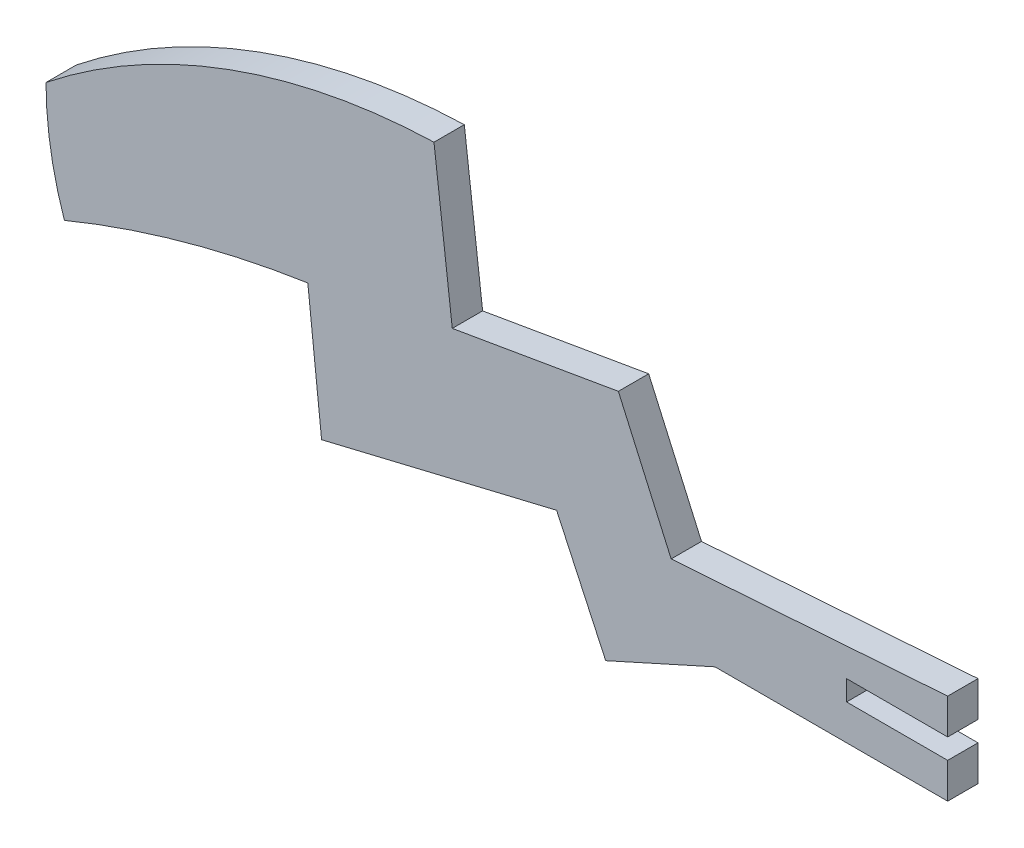
ISO-10303-21;
HEADER;
FILE_DESCRIPTION(('STEP AP214'),'2;1');
FILE_NAME('part.step','',(''),(''),'','','');
FILE_SCHEMA(('AUTOMOTIVE_DESIGN { 1 0 10303 214 1 1 1 1 }'));
ENDSEC;
DATA;
#1=APPLICATION_CONTEXT('core data for automotive mechanical design processes');
#2=APPLICATION_PROTOCOL_DEFINITION('international standard','automotive_design',2000,#1);
#3=PRODUCT_CONTEXT('',#1,'mechanical');
#4=PRODUCT('Part','Part','',(#3));
#5=PRODUCT_RELATED_PRODUCT_CATEGORY('part','',(#4));
#6=PRODUCT_DEFINITION_FORMATION('','',#4);
#7=PRODUCT_DEFINITION_CONTEXT('part definition',#1,'design');
#8=PRODUCT_DEFINITION('design','',#6,#7);
#9=PRODUCT_DEFINITION_SHAPE('','',#8);
#10=(LENGTH_UNIT() NAMED_UNIT(*) SI_UNIT(.MILLI.,.METRE.));
#11=(NAMED_UNIT(*) PLANE_ANGLE_UNIT() SI_UNIT($,.RADIAN.));
#12=(NAMED_UNIT(*) SI_UNIT($,.STERADIAN.) SOLID_ANGLE_UNIT());
#13=UNCERTAINTY_MEASURE_WITH_UNIT(LENGTH_MEASURE(1.E-05),#10,'distance_accuracy_value','');
#14=(GEOMETRIC_REPRESENTATION_CONTEXT(3) GLOBAL_UNCERTAINTY_ASSIGNED_CONTEXT((#13)) GLOBAL_UNIT_ASSIGNED_CONTEXT((#10,
#11,#12)) REPRESENTATION_CONTEXT('',''));
#15=CARTESIAN_POINT('',(0.,0.,0.));
#16=DIRECTION('',(0.,0.,1.));
#17=DIRECTION('',(1.,0.,0.));
#18=AXIS2_PLACEMENT_3D('',#15,#16,#17);
#19=CARTESIAN_POINT('',(29.713162877295,-25.3143678043269,3.));
#20=DIRECTION('',(0.,0.,-1.));
#21=DIRECTION('',(-1.,0.,0.));
#22=AXIS2_PLACEMENT_3D('',#19,#20,#21);
#23=CYLINDRICAL_SURFACE('',#22,64.8731226921538);
#24=CARTESIAN_POINT('',(29.713162877295,-25.3143678043269,0.));
#25=DIRECTION('',(0.,0.,1.));
#26=DIRECTION('',(1.,0.,0.));
#27=AXIS2_PLACEMENT_3D('',#24,#25,#26);
#28=CIRCLE('',#27,64.8731226921538);
#29=CARTESIAN_POINT('',(27.703067566427,39.5276059832782,0.));
#30=VERTEX_POINT('',#29);
#31=CARTESIAN_POINT('',(-10.6739269143685,25.4537819156634,0.));
#32=VERTEX_POINT('',#31);
#33=EDGE_CURVE('E183',#30,#32,#28,.T.);
#34=ORIENTED_EDGE('',*,*,#33,.T.);
#35=DIRECTION('',(0.,0.,-1.));
#36=VECTOR('',#35,1.);
#37=CARTESIAN_POINT('',(-10.6739269143685,25.4537819156634,3.));
#38=LINE('',#37,#36);
#39=CARTESIAN_POINT('',(-10.6739269143685,25.4537819156634,3.));
#40=VERTEX_POINT('',#39);
#41=EDGE_CURVE('E11',#40,#32,#38,.T.);
#42=ORIENTED_EDGE('',*,*,#41,.F.);
#43=CARTESIAN_POINT('',(29.713162877295,-25.3143678043269,3.));
#44=DIRECTION('',(0.,0.,1.));
#45=DIRECTION('',(1.,0.,0.));
#46=AXIS2_PLACEMENT_3D('',#43,#44,#45);
#47=CIRCLE('',#46,64.8731226921538);
#48=CARTESIAN_POINT('',(27.703067566427,39.5276059832782,3.));
#49=VERTEX_POINT('',#48);
#50=EDGE_CURVE('E216',#49,#40,#47,.T.);
#51=ORIENTED_EDGE('',*,*,#50,.F.);
#52=DIRECTION('',(0.,0.,-1.));
#53=VECTOR('',#52,1.);
#54=CARTESIAN_POINT('',(27.703067566427,39.5276059832782,3.));
#55=LINE('',#54,#53);
#56=EDGE_CURVE('E179',#49,#30,#55,.T.);
#57=ORIENTED_EDGE('',*,*,#56,.T.);
#58=EDGE_LOOP('',(#34,#42,#51,#57));
#59=FACE_BOUND('',#58,.T.);
#60=ADVANCED_FACE('F33',(#59),#23,.T.);
#61=CARTESIAN_POINT('',(23.1098661568595,25.4906827853954,3.));
#62=DIRECTION('',(0.,0.,-1.));
#63=DIRECTION('',(-1.,0.,0.));
#64=AXIS2_PLACEMENT_3D('',#61,#62,#63);
#65=CYLINDRICAL_SURFACE('',#64,33.7838132239944);
#66=CARTESIAN_POINT('',(23.1098661568595,25.4906827853954,0.));
#67=DIRECTION('',(0.,0.,1.));
#68=DIRECTION('',(1.,0.,0.));
#69=AXIS2_PLACEMENT_3D('',#66,#67,#68);
#70=CIRCLE('',#69,33.7838132239944);
#71=CARTESIAN_POINT('',(-8.85422266202396,14.5525356876339,0.));
#72=VERTEX_POINT('',#71);
#73=EDGE_CURVE('E186',#32,#72,#70,.T.);
#74=ORIENTED_EDGE('',*,*,#73,.T.);
#75=DIRECTION('',(0.,0.,-1.));
#76=VECTOR('',#75,1.);
#77=CARTESIAN_POINT('',(-8.85422266202396,14.5525356876339,3.));
#78=LINE('',#77,#76);
#79=CARTESIAN_POINT('',(-8.85422266202396,14.5525356876339,3.));
#80=VERTEX_POINT('',#79);
#81=EDGE_CURVE('E41',#80,#72,#78,.T.);
#82=ORIENTED_EDGE('',*,*,#81,.F.);
#83=CARTESIAN_POINT('',(23.1098661568595,25.4906827853954,3.));
#84=DIRECTION('',(0.,0.,1.));
#85=DIRECTION('',(1.,0.,0.));
#86=AXIS2_PLACEMENT_3D('',#83,#84,#85);
#87=CIRCLE('',#86,33.7838132239944);
#88=EDGE_CURVE('E119',#40,#80,#87,.T.);
#89=ORIENTED_EDGE('',*,*,#88,.F.);
#90=ORIENTED_EDGE('',*,*,#41,.T.);
#91=EDGE_LOOP('',(#74,#82,#89,#90));
#92=FACE_BOUND('',#91,.T.);
#93=ADVANCED_FACE('F319',(#92),#65,.T.);
#94=CARTESIAN_POINT('',(30.7068916071302,-81.4038849932265,3.));
#95=DIRECTION('',(0.,0.,-1.));
#96=DIRECTION('',(-1.,0.,0.));
#97=AXIS2_PLACEMENT_3D('',#94,#95,#96);
#98=CYLINDRICAL_SURFACE('',#97,103.79169731775);
#99=CARTESIAN_POINT('',(30.7068916071302,-81.4038849932265,0.));
#100=DIRECTION('',(0.,0.,-1.));
#101=DIRECTION('',(1.,0.,0.));
#102=AXIS2_PLACEMENT_3D('',#99,#100,#101);
#103=CIRCLE('',#102,103.79169731775);
#104=CARTESIAN_POINT('',(15.2236739770585,21.2264536202613,0.));
#105=VERTEX_POINT('',#104);
#106=EDGE_CURVE('E188',#72,#105,#103,.T.);
#107=ORIENTED_EDGE('',*,*,#106,.T.);
#108=DIRECTION('',(0.,0.,-1.));
#109=VECTOR('',#108,1.);
#110=CARTESIAN_POINT('',(15.2236739770585,21.2264536202613,3.));
#111=LINE('',#110,#109);
#112=CARTESIAN_POINT('',(15.2236739770585,21.2264536202613,3.));
#113=VERTEX_POINT('',#112);
#114=EDGE_CURVE('E250',#113,#105,#111,.T.);
#115=ORIENTED_EDGE('',*,*,#114,.F.);
#116=CARTESIAN_POINT('',(30.7068916071302,-81.4038849932265,3.));
#117=DIRECTION('',(0.,0.,-1.));
#118=DIRECTION('',(1.,0.,0.));
#119=AXIS2_PLACEMENT_3D('',#116,#117,#118);
#120=CIRCLE('',#119,103.79169731775);
#121=EDGE_CURVE('E258',#80,#113,#120,.T.);
#122=ORIENTED_EDGE('',*,*,#121,.F.);
#123=ORIENTED_EDGE('',*,*,#81,.T.);
#124=EDGE_LOOP('',(#107,#115,#122,#123));
#125=FACE_BOUND('',#124,.T.);
#126=ADVANCED_FACE('F256',(#125),#98,.F.);
#127=CARTESIAN_POINT('',(16.5860593290045,8.48039401672179,3.));
#128=DIRECTION('',(0.99433609317819,0.106281389730907,0.));
#129=DIRECTION('',(-0.106281389730907,0.994336093178191,0.));
#130=AXIS2_PLACEMENT_3D('',#127,#128,#129);
#131=PLANE('',#130);
#132=DIRECTION('',(0.106281389730907,-0.99433609317819,0.));
#133=VECTOR('',#132,1.);
#134=CARTESIAN_POINT('',(16.5860593290045,8.48039401672179,0.));
#135=LINE('',#134,#133);
#136=CARTESIAN_POINT('',(16.5860593290045,8.48039401672179,0.));
#137=VERTEX_POINT('',#136);
#138=EDGE_CURVE('E190',#105,#137,#135,.T.);
#139=ORIENTED_EDGE('',*,*,#138,.T.);
#140=DIRECTION('',(0.,0.,-1.));
#141=VECTOR('',#140,1.);
#142=CARTESIAN_POINT('',(16.5860593290045,8.48039401672179,3.));
#143=LINE('',#142,#141);
#144=CARTESIAN_POINT('',(16.5860593290045,8.48039401672179,3.));
#145=VERTEX_POINT('',#144);
#146=EDGE_CURVE('E247',#145,#137,#143,.T.);
#147=ORIENTED_EDGE('',*,*,#146,.F.);
#148=DIRECTION('',(0.106281389730907,-0.99433609317819,0.));
#149=VECTOR('',#148,1.);
#150=CARTESIAN_POINT('',(16.5860593290045,8.48039401672179,3.));
#151=LINE('',#150,#149);
#152=EDGE_CURVE('E276',#113,#145,#151,.T.);
#153=ORIENTED_EDGE('',*,*,#152,.F.);
#154=ORIENTED_EDGE('',*,*,#114,.T.);
#155=EDGE_LOOP('',(#139,#147,#153,#154));
#156=FACE_BOUND('',#155,.T.);
#157=ADVANCED_FACE('F267',(#156),#131,.F.);
#158=CARTESIAN_POINT('',(39.8319188868193,14.0605930201914,3.));
#159=DIRECTION('',(-0.233420126111625,0.972375979097608,0.));
#160=DIRECTION('',(-0.972375979097609,-0.233420126111625,0.));
#161=AXIS2_PLACEMENT_3D('',#158,#159,#160);
#162=PLANE('',#161);
#163=DIRECTION('',(0.972375979097609,0.233420126111625,0.));
#164=VECTOR('',#163,1.);
#165=CARTESIAN_POINT('',(39.8319188868193,14.0605930201914,0.));
#166=LINE('',#165,#164);
#167=CARTESIAN_POINT('',(39.8319188868193,14.0605930201914,0.));
#168=VERTEX_POINT('',#167);
#169=EDGE_CURVE('E192',#137,#168,#166,.T.);
#170=ORIENTED_EDGE('',*,*,#169,.T.);
#171=DIRECTION('',(0.,0.,-1.));
#172=VECTOR('',#171,1.);
#173=CARTESIAN_POINT('',(39.8319188868193,14.0605930201914,3.));
#174=LINE('',#173,#172);
#175=CARTESIAN_POINT('',(39.8319188868193,14.0605930201914,3.));
#176=VERTEX_POINT('',#175);
#177=EDGE_CURVE('E244',#176,#168,#174,.T.);
#178=ORIENTED_EDGE('',*,*,#177,.F.);
#179=DIRECTION('',(0.972375979097609,0.233420126111625,0.));
#180=VECTOR('',#179,1.);
#181=CARTESIAN_POINT('',(39.8319188868193,14.0605930201914,3.));
#182=LINE('',#181,#180);
#183=EDGE_CURVE('E273',#145,#176,#182,.T.);
#184=ORIENTED_EDGE('',*,*,#183,.F.);
#185=ORIENTED_EDGE('',*,*,#146,.T.);
#186=EDGE_LOOP('',(#170,#178,#184,#185));
#187=FACE_BOUND('',#186,.T.);
#188=ADVANCED_FACE('F271',(#187),#162,.F.);
#189=CARTESIAN_POINT('',(44.6870891655121,3.6032223236961,3.));
#190=DIRECTION('',(0.907010211533052,0.421108627523551,0.));
#191=DIRECTION('',(-0.421108627523551,0.907010211533052,0.));
#192=AXIS2_PLACEMENT_3D('',#189,#190,#191);
#193=PLANE('',#192);
#194=DIRECTION('',(0.421108627523551,-0.907010211533052,0.));
#195=VECTOR('',#194,1.);
#196=CARTESIAN_POINT('',(44.6870891655121,3.6032223236961,0.));
#197=LINE('',#196,#195);
#198=CARTESIAN_POINT('',(44.6870891655121,3.6032223236961,0.));
#199=VERTEX_POINT('',#198);
#200=EDGE_CURVE('E194',#168,#199,#197,.T.);
#201=ORIENTED_EDGE('',*,*,#200,.T.);
#202=DIRECTION('',(0.,0.,-1.));
#203=VECTOR('',#202,1.);
#204=CARTESIAN_POINT('',(44.6870891655121,3.6032223236961,3.));
#205=LINE('',#204,#203);
#206=CARTESIAN_POINT('',(44.6870891655121,3.6032223236961,3.));
#207=VERTEX_POINT('',#206);
#208=EDGE_CURVE('E241',#207,#199,#205,.T.);
#209=ORIENTED_EDGE('',*,*,#208,.F.);
#210=DIRECTION('',(0.421108627523551,-0.907010211533052,0.));
#211=VECTOR('',#210,1.);
#212=CARTESIAN_POINT('',(44.6870891655121,3.6032223236961,3.));
#213=LINE('',#212,#211);
#214=EDGE_CURVE('E275',#176,#207,#213,.T.);
#215=ORIENTED_EDGE('',*,*,#214,.F.);
#216=ORIENTED_EDGE('',*,*,#177,.T.);
#217=EDGE_LOOP('',(#201,#209,#215,#216));
#218=FACE_BOUND('',#217,.T.);
#219=ADVANCED_FACE('F332',(#218),#193,.F.);
#220=CARTESIAN_POINT('',(55.4938016916878,8.4803940167218,3.));
#221=DIRECTION('',(-0.411356989318595,0.911474315238088,0.));
#222=DIRECTION('',(-0.911474315238088,-0.411356989318595,0.));
#223=AXIS2_PLACEMENT_3D('',#220,#221,#222);
#224=PLANE('',#223);
#225=DIRECTION('',(0.911474315238088,0.411356989318595,0.));
#226=VECTOR('',#225,1.);
#227=CARTESIAN_POINT('',(55.4938016916878,8.4803940167218,0.));
#228=LINE('',#227,#226);
#229=CARTESIAN_POINT('',(55.4938016916878,8.4803940167218,0.));
#230=VERTEX_POINT('',#229);
#231=EDGE_CURVE('E196',#199,#230,#228,.T.);
#232=ORIENTED_EDGE('',*,*,#231,.T.);
#233=DIRECTION('',(0.,0.,-1.));
#234=VECTOR('',#233,1.);
#235=CARTESIAN_POINT('',(55.4938016916878,8.4803940167218,3.));
#236=LINE('',#235,#234);
#237=CARTESIAN_POINT('',(55.4938016916878,8.4803940167218,3.));
#238=VERTEX_POINT('',#237);
#239=EDGE_CURVE('E238',#238,#230,#236,.T.);
#240=ORIENTED_EDGE('',*,*,#239,.F.);
#241=DIRECTION('',(0.911474315238088,0.411356989318595,0.));
#242=VECTOR('',#241,1.);
#243=CARTESIAN_POINT('',(55.4938016916878,8.4803940167218,3.));
#244=LINE('',#243,#242);
#245=EDGE_CURVE('E278',#207,#238,#244,.T.);
#246=ORIENTED_EDGE('',*,*,#245,.F.);
#247=ORIENTED_EDGE('',*,*,#208,.T.);
#248=EDGE_LOOP('',(#232,#240,#246,#247));
#249=FACE_BOUND('',#248,.T.);
#250=ADVANCED_FACE('F335',(#249),#224,.F.);
#251=CARTESIAN_POINT('',(78.5125853921047,8.4803940167218,3.));
#252=DIRECTION('',(0.,1.,0.));
#253=DIRECTION('',(0.,0.,1.));
#254=AXIS2_PLACEMENT_3D('',#251,#252,#253);
#255=PLANE('',#254);
#256=DIRECTION('',(1.,0.,0.));
#257=VECTOR('',#256,1.);
#258=CARTESIAN_POINT('',(78.5125853921047,8.4803940167218,0.));
#259=LINE('',#258,#257);
#260=CARTESIAN_POINT('',(78.5125853921047,8.4803940167218,0.));
#261=VERTEX_POINT('',#260);
#262=EDGE_CURVE('E199',#230,#261,#259,.T.);
#263=ORIENTED_EDGE('',*,*,#262,.T.);
#264=DIRECTION('',(0.,0.,-1.));
#265=VECTOR('',#264,1.);
#266=CARTESIAN_POINT('',(78.5125853921047,8.4803940167218,3.));
#267=LINE('',#266,#265);
#268=CARTESIAN_POINT('',(78.5125853921047,8.4803940167218,3.));
#269=VERTEX_POINT('',#268);
#270=EDGE_CURVE('E235',#269,#261,#267,.T.);
#271=ORIENTED_EDGE('',*,*,#270,.F.);
#272=DIRECTION('',(1.,0.,0.));
#273=VECTOR('',#272,1.);
#274=CARTESIAN_POINT('',(67.5031935418962,8.4803940167218,3.));
#275=LINE('',#274,#273);
#276=EDGE_CURVE('E284',#238,#269,#275,.T.);
#277=ORIENTED_EDGE('',*,*,#276,.F.);
#278=ORIENTED_EDGE('',*,*,#239,.T.);
#279=EDGE_LOOP('',(#263,#271,#277,#278));
#280=FACE_BOUND('',#279,.T.);
#281=ADVANCED_FACE('F339',(#280),#255,.F.);
#282=CARTESIAN_POINT('',(78.5125853921047,11.9803940167218,3.));
#283=DIRECTION('',(-1.,0.,0.));
#284=DIRECTION('',(0.,0.,1.));
#285=AXIS2_PLACEMENT_3D('',#282,#283,#284);
#286=PLANE('',#285);
#287=DIRECTION('',(0.,1.,0.));
#288=VECTOR('',#287,1.);
#289=CARTESIAN_POINT('',(78.5125853921047,11.9803940167218,0.));
#290=LINE('',#289,#288);
#291=CARTESIAN_POINT('',(78.5125853921047,11.9803940167218,0.));
#292=VERTEX_POINT('',#291);
#293=EDGE_CURVE('E201',#261,#292,#290,.T.);
#294=ORIENTED_EDGE('',*,*,#293,.T.);
#295=DIRECTION('',(0.,0.,-1.));
#296=VECTOR('',#295,1.);
#297=CARTESIAN_POINT('',(78.5125853921047,11.9803940167218,3.));
#298=LINE('',#297,#296);
#299=CARTESIAN_POINT('',(78.5125853921047,11.9803940167218,3.));
#300=VERTEX_POINT('',#299);
#301=EDGE_CURVE('E232',#300,#292,#298,.T.);
#302=ORIENTED_EDGE('',*,*,#301,.F.);
#303=DIRECTION('',(0.,1.,0.));
#304=VECTOR('',#303,1.);
#305=CARTESIAN_POINT('',(78.5125853921047,11.9803940167218,3.));
#306=LINE('',#305,#304);
#307=EDGE_CURVE('E286',#269,#300,#306,.T.);
#308=ORIENTED_EDGE('',*,*,#307,.F.);
#309=ORIENTED_EDGE('',*,*,#270,.T.);
#310=EDGE_LOOP('',(#294,#302,#308,#309));
#311=FACE_BOUND('',#310,.T.);
#312=ADVANCED_FACE('F343',(#311),#286,.F.);
#313=CARTESIAN_POINT('',(68.5125853921047,11.9803940167218,3.));
#314=DIRECTION('',(0.,-1.,0.));
#315=DIRECTION('',(0.,0.,-1.));
#316=AXIS2_PLACEMENT_3D('',#313,#314,#315);
#317=PLANE('',#316);
#318=DIRECTION('',(-1.,0.,0.));
#319=VECTOR('',#318,1.);
#320=CARTESIAN_POINT('',(68.5125853921047,11.9803940167218,0.));
#321=LINE('',#320,#319);
#322=CARTESIAN_POINT('',(68.5125853921047,11.9803940167218,0.));
#323=VERTEX_POINT('',#322);
#324=EDGE_CURVE('E203',#292,#323,#321,.T.);
#325=ORIENTED_EDGE('',*,*,#324,.T.);
#326=DIRECTION('',(0.,0.,-1.));
#327=VECTOR('',#326,1.);
#328=CARTESIAN_POINT('',(68.5125853921047,11.9803940167218,3.));
#329=LINE('',#328,#327);
#330=CARTESIAN_POINT('',(68.5125853921047,11.9803940167218,3.));
#331=VERTEX_POINT('',#330);
#332=EDGE_CURVE('E229',#331,#323,#329,.T.);
#333=ORIENTED_EDGE('',*,*,#332,.F.);
#334=DIRECTION('',(-1.,0.,0.));
#335=VECTOR('',#334,1.);
#336=CARTESIAN_POINT('',(68.5125853921047,11.9803940167218,3.));
#337=LINE('',#336,#335);
#338=EDGE_CURVE('E288',#300,#331,#337,.T.);
#339=ORIENTED_EDGE('',*,*,#338,.F.);
#340=ORIENTED_EDGE('',*,*,#301,.T.);
#341=EDGE_LOOP('',(#325,#333,#339,#340));
#342=FACE_BOUND('',#341,.T.);
#343=ADVANCED_FACE('F347',(#342),#317,.F.);
#344=CARTESIAN_POINT('',(68.5125853921047,13.9803940167218,3.));
#345=DIRECTION('',(-1.,0.,0.));
#346=DIRECTION('',(0.,0.,1.));
#347=AXIS2_PLACEMENT_3D('',#344,#345,#346);
#348=PLANE('',#347);
#349=DIRECTION('',(0.,1.,0.));
#350=VECTOR('',#349,1.);
#351=CARTESIAN_POINT('',(68.5125853921047,13.9803940167218,0.));
#352=LINE('',#351,#350);
#353=CARTESIAN_POINT('',(68.5125853921047,13.9803940167218,0.));
#354=VERTEX_POINT('',#353);
#355=EDGE_CURVE('E205',#323,#354,#352,.T.);
#356=ORIENTED_EDGE('',*,*,#355,.T.);
#357=DIRECTION('',(0.,0.,-1.));
#358=VECTOR('',#357,1.);
#359=CARTESIAN_POINT('',(68.5125853921047,13.9803940167218,3.));
#360=LINE('',#359,#358);
#361=CARTESIAN_POINT('',(68.5125853921047,13.9803940167218,3.));
#362=VERTEX_POINT('',#361);
#363=EDGE_CURVE('E226',#362,#354,#360,.T.);
#364=ORIENTED_EDGE('',*,*,#363,.F.);
#365=DIRECTION('',(0.,1.,0.));
#366=VECTOR('',#365,1.);
#367=CARTESIAN_POINT('',(68.5125853921047,13.9803940167218,3.));
#368=LINE('',#367,#366);
#369=EDGE_CURVE('E290',#331,#362,#368,.T.);
#370=ORIENTED_EDGE('',*,*,#369,.F.);
#371=ORIENTED_EDGE('',*,*,#332,.T.);
#372=EDGE_LOOP('',(#356,#364,#370,#371));
#373=FACE_BOUND('',#372,.T.);
#374=ADVANCED_FACE('F351',(#373),#348,.F.);
#375=CARTESIAN_POINT('',(78.5125853921047,13.9803940167218,3.));
#376=DIRECTION('',(0.,1.,0.));
#377=DIRECTION('',(0.,0.,1.));
#378=AXIS2_PLACEMENT_3D('',#375,#376,#377);
#379=PLANE('',#378);
#380=DIRECTION('',(1.,0.,0.));
#381=VECTOR('',#380,1.);
#382=CARTESIAN_POINT('',(78.5125853921047,13.9803940167218,0.));
#383=LINE('',#382,#381);
#384=CARTESIAN_POINT('',(78.5125853921047,13.9803940167218,0.));
#385=VERTEX_POINT('',#384);
#386=EDGE_CURVE('E207',#354,#385,#383,.T.);
#387=ORIENTED_EDGE('',*,*,#386,.T.);
#388=DIRECTION('',(0.,0.,-1.));
#389=VECTOR('',#388,1.);
#390=CARTESIAN_POINT('',(78.5125853921047,13.9803940167218,3.));
#391=LINE('',#390,#389);
#392=CARTESIAN_POINT('',(78.5125853921047,13.9803940167218,3.));
#393=VERTEX_POINT('',#392);
#394=EDGE_CURVE('E223',#393,#385,#391,.T.);
#395=ORIENTED_EDGE('',*,*,#394,.F.);
#396=DIRECTION('',(1.,0.,0.));
#397=VECTOR('',#396,1.);
#398=CARTESIAN_POINT('',(78.5125853921047,13.9803940167218,3.));
#399=LINE('',#398,#397);
#400=EDGE_CURVE('E292',#362,#393,#399,.T.);
#401=ORIENTED_EDGE('',*,*,#400,.F.);
#402=ORIENTED_EDGE('',*,*,#363,.T.);
#403=EDGE_LOOP('',(#387,#395,#401,#402));
#404=FACE_BOUND('',#403,.T.);
#405=ADVANCED_FACE('F355',(#404),#379,.F.);
#406=CARTESIAN_POINT('',(78.5125853921047,17.4803940167218,3.));
#407=DIRECTION('',(-1.,0.,0.));
#408=DIRECTION('',(0.,0.,1.));
#409=AXIS2_PLACEMENT_3D('',#406,#407,#408);
#410=PLANE('',#409);
#411=DIRECTION('',(0.,1.,0.));
#412=VECTOR('',#411,1.);
#413=CARTESIAN_POINT('',(78.5125853921047,17.4803940167218,0.));
#414=LINE('',#413,#412);
#415=CARTESIAN_POINT('',(78.5125853921047,17.4803940167218,0.));
#416=VERTEX_POINT('',#415);
#417=EDGE_CURVE('E209',#385,#416,#414,.T.);
#418=ORIENTED_EDGE('',*,*,#417,.T.);
#419=DIRECTION('',(0.,0.,-1.));
#420=VECTOR('',#419,1.);
#421=CARTESIAN_POINT('',(78.5125853921047,17.4803940167218,3.));
#422=LINE('',#421,#420);
#423=CARTESIAN_POINT('',(78.5125853921047,17.4803940167218,3.));
#424=VERTEX_POINT('',#423);
#425=EDGE_CURVE('E220',#424,#416,#422,.T.);
#426=ORIENTED_EDGE('',*,*,#425,.F.);
#427=DIRECTION('',(0.,1.,0.));
#428=VECTOR('',#427,1.);
#429=CARTESIAN_POINT('',(78.5125853921047,17.4803940167218,3.));
#430=LINE('',#429,#428);
#431=EDGE_CURVE('E294',#393,#424,#430,.T.);
#432=ORIENTED_EDGE('',*,*,#431,.F.);
#433=ORIENTED_EDGE('',*,*,#394,.T.);
#434=EDGE_LOOP('',(#418,#426,#432,#433));
#435=FACE_BOUND('',#434,.T.);
#436=ADVANCED_FACE('F300',(#435),#410,.F.);
#437=CARTESIAN_POINT('',(78.5125853921047,17.4803940167218,3.));
#438=DIRECTION('',(0.0702017453382749,-0.997532813972282,0.));
#439=DIRECTION('',(0.997532813972282,0.0702017453382749,0.));
#440=AXIS2_PLACEMENT_3D('',#437,#438,#439);
#441=PLANE('',#440);
#442=DIRECTION('',(-0.997532813972282,-0.0702017453382749,0.));
#443=VECTOR('',#442,1.);
#444=CARTESIAN_POINT('',(78.5125853921047,17.4803940167218,0.));
#445=LINE('',#444,#443);
#446=CARTESIAN_POINT('',(51.1612580511734,15.5555341126092,0.));
#447=VERTEX_POINT('',#446);
#448=EDGE_CURVE('E211',#416,#447,#445,.T.);
#449=ORIENTED_EDGE('',*,*,#448,.T.);
#450=DIRECTION('',(0.,0.,-1.));
#451=VECTOR('',#450,1.);
#452=CARTESIAN_POINT('',(51.1612580511734,15.5555341126092,3.));
#453=LINE('',#452,#451);
#454=CARTESIAN_POINT('',(51.1612580511734,15.5555341126092,3.));
#455=VERTEX_POINT('',#454);
#456=EDGE_CURVE('E174',#455,#447,#453,.T.);
#457=ORIENTED_EDGE('',*,*,#456,.F.);
#458=DIRECTION('',(-0.997532813972282,-0.0702017453382749,0.));
#459=VECTOR('',#458,1.);
#460=CARTESIAN_POINT('',(78.5125853921047,17.4803940167218,3.));
#461=LINE('',#460,#459);
#462=EDGE_CURVE('E165',#424,#455,#461,.T.);
#463=ORIENTED_EDGE('',*,*,#462,.F.);
#464=ORIENTED_EDGE('',*,*,#425,.T.);
#465=EDGE_LOOP('',(#449,#457,#463,#464));
#466=FACE_BOUND('',#465,.T.);
#467=ADVANCED_FACE('F304',(#466),#441,.F.);
#468=CARTESIAN_POINT('',(51.1612580511734,15.5555341126092,3.));
#469=DIRECTION('',(-0.913794239838535,-0.406177408576492,0.));
#470=DIRECTION('',(0.406177408576492,-0.913794239838535,0.));
#471=AXIS2_PLACEMENT_3D('',#468,#469,#470);
#472=PLANE('',#471);
#473=DIRECTION('',(-0.406177408576492,0.913794239838535,0.));
#474=VECTOR('',#473,1.);
#475=CARTESIAN_POINT('',(51.1612580511734,15.5555341126092,0.));
#476=LINE('',#475,#474);
#477=CARTESIAN_POINT('',(45.9388819909911,27.3045311304149,0.));
#478=VERTEX_POINT('',#477);
#479=EDGE_CURVE('E173',#447,#478,#476,.T.);
#480=ORIENTED_EDGE('',*,*,#479,.T.);
#481=DIRECTION('',(0.,0.,-1.));
#482=VECTOR('',#481,1.);
#483=CARTESIAN_POINT('',(45.9388819909911,27.3045311304149,3.));
#484=LINE('',#483,#482);
#485=CARTESIAN_POINT('',(45.9388819909911,27.3045311304149,3.));
#486=VERTEX_POINT('',#485);
#487=EDGE_CURVE('E170',#486,#478,#484,.T.);
#488=ORIENTED_EDGE('',*,*,#487,.F.);
#489=DIRECTION('',(-0.406177408576492,0.913794239838535,0.));
#490=VECTOR('',#489,1.);
#491=CARTESIAN_POINT('',(51.1612580511734,15.5555341126092,3.));
#492=LINE('',#491,#490);
#493=EDGE_CURVE('E159',#455,#486,#492,.T.);
#494=ORIENTED_EDGE('',*,*,#493,.F.);
#495=ORIENTED_EDGE('',*,*,#456,.T.);
#496=EDGE_LOOP('',(#480,#488,#494,#495));
#497=FACE_BOUND('',#496,.T.);
#498=ADVANCED_FACE('F171',(#497),#472,.F.);
#499=CARTESIAN_POINT('',(45.9388819909911,27.3045311304149,3.));
#500=DIRECTION('',(0.169441763299948,-0.985540201539138,0.));
#501=DIRECTION('',(0.985540201539138,0.169441763299948,0.));
#502=AXIS2_PLACEMENT_3D('',#499,#500,#501);
#503=PLANE('',#502);
#504=DIRECTION('',(-0.985540201539138,-0.169441763299948,0.));
#505=VECTOR('',#504,1.);
#506=CARTESIAN_POINT('',(45.9388819909911,27.3045311304149,0.));
#507=LINE('',#506,#505);
#508=CARTESIAN_POINT('',(29.5125853921047,24.4803940167218,0.));
#509=VERTEX_POINT('',#508);
#510=EDGE_CURVE('E105',#478,#509,#507,.T.);
#511=ORIENTED_EDGE('',*,*,#510,.T.);
#512=DIRECTION('',(0.,0.,-1.));
#513=VECTOR('',#512,1.);
#514=CARTESIAN_POINT('',(29.5125853921047,24.4803940167218,3.));
#515=LINE('',#514,#513);
#516=CARTESIAN_POINT('',(29.5125853921047,24.4803940167218,3.));
#517=VERTEX_POINT('',#516);
#518=EDGE_CURVE('E175',#517,#509,#515,.T.);
#519=ORIENTED_EDGE('',*,*,#518,.F.);
#520=DIRECTION('',(-0.985540201539138,-0.169441763299948,0.));
#521=VECTOR('',#520,1.);
#522=CARTESIAN_POINT('',(45.9388819909911,27.3045311304149,3.));
#523=LINE('',#522,#521);
#524=EDGE_CURVE('E163',#486,#517,#523,.T.);
#525=ORIENTED_EDGE('',*,*,#524,.F.);
#526=ORIENTED_EDGE('',*,*,#487,.T.);
#527=EDGE_LOOP('',(#511,#519,#525,#526));
#528=FACE_BOUND('',#527,.T.);
#529=ADVANCED_FACE('F177',(#528),#503,.F.);
#530=CARTESIAN_POINT('',(29.5125853921047,24.4803940167218,3.));
#531=DIRECTION('',(-0.992846737215125,-0.119395797251328,0.));
#532=DIRECTION('',(0.119395797251328,-0.992846737215125,0.));
#533=AXIS2_PLACEMENT_3D('',#530,#531,#532);
#534=PLANE('',#533);
#535=DIRECTION('',(-0.119395797251328,0.992846737215125,0.));
#536=VECTOR('',#535,1.);
#537=CARTESIAN_POINT('',(29.5125853921047,24.4803940167218,0.));
#538=LINE('',#537,#536);
#539=EDGE_CURVE('E111',#509,#30,#538,.T.);
#540=ORIENTED_EDGE('',*,*,#539,.T.);
#541=ORIENTED_EDGE('',*,*,#56,.F.);
#542=DIRECTION('',(-0.119395797251328,0.992846737215125,0.));
#543=VECTOR('',#542,1.);
#544=CARTESIAN_POINT('',(29.5125853921047,24.4803940167218,3.));
#545=LINE('',#544,#543);
#546=EDGE_CURVE('E49',#517,#49,#545,.T.);
#547=ORIENTED_EDGE('',*,*,#546,.F.);
#548=ORIENTED_EDGE('',*,*,#518,.T.);
#549=EDGE_LOOP('',(#540,#541,#547,#548));
#550=FACE_BOUND('',#549,.T.);
#551=ADVANCED_FACE('F308',(#550),#534,.F.);
#552=CARTESIAN_POINT('',(29.713162877295,-25.3143678043269,3.));
#553=DIRECTION('',(0.,0.,1.));
#554=DIRECTION('',(1.,0.,0.));
#555=AXIS2_PLACEMENT_3D('',#552,#553,#554);
#556=PLANE('',#555);
#557=ORIENTED_EDGE('',*,*,#50,.T.);
#558=ORIENTED_EDGE('',*,*,#88,.T.);
#559=ORIENTED_EDGE('',*,*,#121,.T.);
#560=ORIENTED_EDGE('',*,*,#152,.T.);
#561=ORIENTED_EDGE('',*,*,#183,.T.);
#562=ORIENTED_EDGE('',*,*,#214,.T.);
#563=ORIENTED_EDGE('',*,*,#245,.T.);
#564=ORIENTED_EDGE('',*,*,#276,.T.);
#565=ORIENTED_EDGE('',*,*,#307,.T.);
#566=ORIENTED_EDGE('',*,*,#338,.T.);
#567=ORIENTED_EDGE('',*,*,#369,.T.);
#568=ORIENTED_EDGE('',*,*,#400,.T.);
#569=ORIENTED_EDGE('',*,*,#431,.T.);
#570=ORIENTED_EDGE('',*,*,#462,.T.);
#571=ORIENTED_EDGE('',*,*,#493,.T.);
#572=ORIENTED_EDGE('',*,*,#524,.T.);
#573=ORIENTED_EDGE('',*,*,#546,.T.);
#574=EDGE_LOOP('',(#557,#558,#559,#560,#561,#562,#563,#564,#565,#566,#567,#568,#569,#570,#571,
#572,#573));
#575=FACE_BOUND('',#574,.T.);
#576=ADVANCED_FACE('F161',(#575),#556,.T.);
#577=CARTESIAN_POINT('',(29.713162877295,-25.3143678043269,0.));
#578=DIRECTION('',(0.,0.,1.));
#579=DIRECTION('',(1.,0.,0.));
#580=AXIS2_PLACEMENT_3D('',#577,#578,#579);
#581=PLANE('',#580);
#582=ORIENTED_EDGE('',*,*,#33,.F.);
#583=ORIENTED_EDGE('',*,*,#539,.F.);
#584=ORIENTED_EDGE('',*,*,#510,.F.);
#585=ORIENTED_EDGE('',*,*,#479,.F.);
#586=ORIENTED_EDGE('',*,*,#448,.F.);
#587=ORIENTED_EDGE('',*,*,#417,.F.);
#588=ORIENTED_EDGE('',*,*,#386,.F.);
#589=ORIENTED_EDGE('',*,*,#355,.F.);
#590=ORIENTED_EDGE('',*,*,#324,.F.);
#591=ORIENTED_EDGE('',*,*,#293,.F.);
#592=ORIENTED_EDGE('',*,*,#262,.F.);
#593=ORIENTED_EDGE('',*,*,#231,.F.);
#594=ORIENTED_EDGE('',*,*,#200,.F.);
#595=ORIENTED_EDGE('',*,*,#169,.F.);
#596=ORIENTED_EDGE('',*,*,#138,.F.);
#597=ORIENTED_EDGE('',*,*,#106,.F.);
#598=ORIENTED_EDGE('',*,*,#73,.F.);
#599=EDGE_LOOP('',(#582,#583,#584,#585,#586,#587,#588,#589,#590,#591,#592,#593,#594,#595,#596,
#597,#598));
#600=FACE_BOUND('',#599,.T.);
#601=ADVANCED_FACE('F262',(#600),#581,.F.);
#602=CLOSED_SHELL('',(#60,#93,#126,#157,#188,#219,#250,#281,#312,#343,#374,#405,#436,#467,#498,
#529,#551,#576,#601));
#603=MANIFOLD_SOLID_BREP('B2',#602);
#604=ADVANCED_BREP_SHAPE_REPRESENTATION('',(#18,#603),#14);
#605=SHAPE_DEFINITION_REPRESENTATION(#9,#604);
ENDSEC;
END-ISO-10303-21;
